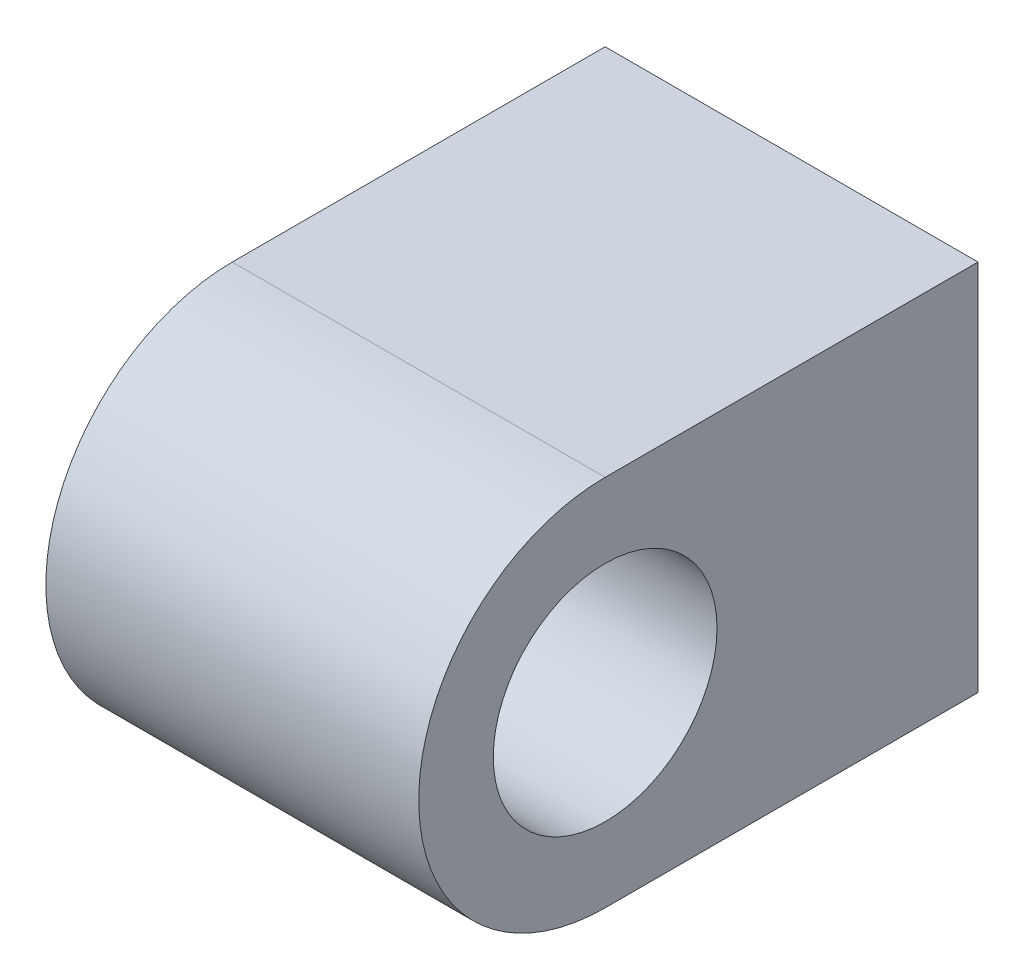
ISO-10303-21;
HEADER;
FILE_DESCRIPTION(('STEP AP214'),'2;1');
FILE_NAME('part.step','',(''),(''),'','','');
FILE_SCHEMA(('AUTOMOTIVE_DESIGN { 1 0 10303 214 1 1 1 1 }'));
ENDSEC;
DATA;
#1=APPLICATION_CONTEXT('core data for automotive mechanical design processes');
#2=APPLICATION_PROTOCOL_DEFINITION('international standard','automotive_design',2000,#1);
#3=PRODUCT_CONTEXT('',#1,'mechanical');
#4=PRODUCT('Part','Part','',(#3));
#5=PRODUCT_RELATED_PRODUCT_CATEGORY('part','',(#4));
#6=PRODUCT_DEFINITION_FORMATION('','',#4);
#7=PRODUCT_DEFINITION_CONTEXT('part definition',#1,'design');
#8=PRODUCT_DEFINITION('design','',#6,#7);
#9=PRODUCT_DEFINITION_SHAPE('','',#8);
#10=(LENGTH_UNIT() NAMED_UNIT(*) SI_UNIT(.MILLI.,.METRE.));
#11=(NAMED_UNIT(*) PLANE_ANGLE_UNIT() SI_UNIT($,.RADIAN.));
#12=(NAMED_UNIT(*) SI_UNIT($,.STERADIAN.) SOLID_ANGLE_UNIT());
#13=UNCERTAINTY_MEASURE_WITH_UNIT(LENGTH_MEASURE(1.E-05),#10,'distance_accuracy_value','');
#14=(GEOMETRIC_REPRESENTATION_CONTEXT(3) GLOBAL_UNCERTAINTY_ASSIGNED_CONTEXT((#13)) GLOBAL_UNIT_ASSIGNED_CONTEXT((#10,
#11,#12)) REPRESENTATION_CONTEXT('',''));
#15=CARTESIAN_POINT('',(0.,0.,0.));
#16=DIRECTION('',(0.,0.,1.));
#17=DIRECTION('',(1.,0.,0.));
#18=AXIS2_PLACEMENT_3D('',#15,#16,#17);
#19=CARTESIAN_POINT('',(5.,2.5,5.));
#20=DIRECTION('',(-1.,0.,0.));
#21=DIRECTION('',(0.,0.,1.));
#22=AXIS2_PLACEMENT_3D('',#19,#20,#21);
#23=CYLINDRICAL_SURFACE('',#22,2.5);
#24=CARTESIAN_POINT('',(0.,2.5,5.));
#25=DIRECTION('',(-1.,0.,0.));
#26=DIRECTION('',(0.,0.,1.));
#27=AXIS2_PLACEMENT_3D('',#24,#25,#26);
#28=CIRCLE('',#27,2.5);
#29=CARTESIAN_POINT('',(0.,0.,5.));
#30=VERTEX_POINT('',#29);
#31=CARTESIAN_POINT('',(0.,5.,5.));
#32=VERTEX_POINT('',#31);
#33=EDGE_CURVE('E98',#30,#32,#28,.T.);
#34=ORIENTED_EDGE('',*,*,#33,.F.);
#35=DIRECTION('',(-1.,0.,0.));
#36=VECTOR('',#35,1.);
#37=CARTESIAN_POINT('',(5.,0.,5.));
#38=LINE('',#37,#36);
#39=CARTESIAN_POINT('',(5.,0.,5.));
#40=VERTEX_POINT('',#39);
#41=EDGE_CURVE('E11',#40,#30,#38,.T.);
#42=ORIENTED_EDGE('',*,*,#41,.F.);
#43=CARTESIAN_POINT('',(5.,2.5,5.));
#44=DIRECTION('',(-1.,0.,0.));
#45=DIRECTION('',(0.,0.,1.));
#46=AXIS2_PLACEMENT_3D('',#43,#44,#45);
#47=CIRCLE('',#46,2.5);
#48=CARTESIAN_POINT('',(5.,5.,5.));
#49=VERTEX_POINT('',#48);
#50=EDGE_CURVE('E91',#40,#49,#47,.T.);
#51=ORIENTED_EDGE('',*,*,#50,.T.);
#52=DIRECTION('',(-1.,0.,0.));
#53=VECTOR('',#52,1.);
#54=CARTESIAN_POINT('',(5.,5.,5.));
#55=LINE('',#54,#53);
#56=EDGE_CURVE('E36',#49,#32,#55,.T.);
#57=ORIENTED_EDGE('',*,*,#56,.T.);
#58=EDGE_LOOP('',(#34,#42,#51,#57));
#59=FACE_BOUND('',#58,.T.);
#60=ADVANCED_FACE('F33',(#59),#23,.T.);
#61=CARTESIAN_POINT('',(5.,0.,0.));
#62=DIRECTION('',(0.,-1.,0.));
#63=DIRECTION('',(0.,0.,-1.));
#64=AXIS2_PLACEMENT_3D('',#61,#62,#63);
#65=PLANE('',#64);
#66=DIRECTION('',(0.,0.,1.));
#67=VECTOR('',#66,1.);
#68=CARTESIAN_POINT('',(0.,0.,0.));
#69=LINE('',#68,#67);
#70=CARTESIAN_POINT('',(0.,0.,0.));
#71=VERTEX_POINT('',#70);
#72=EDGE_CURVE('E93',#71,#30,#69,.T.);
#73=ORIENTED_EDGE('',*,*,#72,.F.);
#74=DIRECTION('',(-1.,0.,0.));
#75=VECTOR('',#74,1.);
#76=CARTESIAN_POINT('',(5.,0.,0.));
#77=LINE('',#76,#75);
#78=CARTESIAN_POINT('',(5.,0.,0.));
#79=VERTEX_POINT('',#78);
#80=EDGE_CURVE('E42',#79,#71,#77,.T.);
#81=ORIENTED_EDGE('',*,*,#80,.F.);
#82=DIRECTION('',(0.,0.,1.));
#83=VECTOR('',#82,1.);
#84=CARTESIAN_POINT('',(5.,0.,0.));
#85=LINE('',#84,#83);
#86=EDGE_CURVE('E88',#79,#40,#85,.T.);
#87=ORIENTED_EDGE('',*,*,#86,.T.);
#88=ORIENTED_EDGE('',*,*,#41,.T.);
#89=EDGE_LOOP('',(#73,#81,#87,#88));
#90=FACE_BOUND('',#89,.T.);
#91=ADVANCED_FACE('F109',(#90),#65,.T.);
#92=CARTESIAN_POINT('',(5.,5.,0.));
#93=DIRECTION('',(0.,0.,-1.));
#94=DIRECTION('',(-1.,0.,0.));
#95=AXIS2_PLACEMENT_3D('',#92,#93,#94);
#96=PLANE('',#95);
#97=DIRECTION('',(0.,-1.,0.));
#98=VECTOR('',#97,1.);
#99=CARTESIAN_POINT('',(0.,5.,0.));
#100=LINE('',#99,#98);
#101=CARTESIAN_POINT('',(0.,5.,0.));
#102=VERTEX_POINT('',#101);
#103=EDGE_CURVE('E83',#102,#71,#100,.T.);
#104=ORIENTED_EDGE('',*,*,#103,.F.);
#105=DIRECTION('',(-1.,0.,0.));
#106=VECTOR('',#105,1.);
#107=CARTESIAN_POINT('',(5.,5.,0.));
#108=LINE('',#107,#106);
#109=CARTESIAN_POINT('',(5.,5.,0.));
#110=VERTEX_POINT('',#109);
#111=EDGE_CURVE('E78',#110,#102,#108,.T.);
#112=ORIENTED_EDGE('',*,*,#111,.F.);
#113=DIRECTION('',(0.,-1.,0.));
#114=VECTOR('',#113,1.);
#115=CARTESIAN_POINT('',(5.,5.,0.));
#116=LINE('',#115,#114);
#117=EDGE_CURVE('E81',#110,#79,#116,.T.);
#118=ORIENTED_EDGE('',*,*,#117,.T.);
#119=ORIENTED_EDGE('',*,*,#80,.T.);
#120=EDGE_LOOP('',(#104,#112,#118,#119));
#121=FACE_BOUND('',#120,.T.);
#122=ADVANCED_FACE('F80',(#121),#96,.T.);
#123=CARTESIAN_POINT('',(5.,5.,5.));
#124=DIRECTION('',(0.,1.,0.));
#125=DIRECTION('',(0.,0.,1.));
#126=AXIS2_PLACEMENT_3D('',#123,#124,#125);
#127=PLANE('',#126);
#128=DIRECTION('',(0.,0.,-1.));
#129=VECTOR('',#128,1.);
#130=CARTESIAN_POINT('',(0.,5.,5.));
#131=LINE('',#130,#129);
#132=EDGE_CURVE('E101',#32,#102,#131,.T.);
#133=ORIENTED_EDGE('',*,*,#132,.F.);
#134=ORIENTED_EDGE('',*,*,#56,.F.);
#135=DIRECTION('',(0.,0.,-1.));
#136=VECTOR('',#135,1.);
#137=CARTESIAN_POINT('',(5.,5.,5.));
#138=LINE('',#137,#136);
#139=EDGE_CURVE('E87',#49,#110,#138,.T.);
#140=ORIENTED_EDGE('',*,*,#139,.T.);
#141=ORIENTED_EDGE('',*,*,#111,.T.);
#142=EDGE_LOOP('',(#133,#134,#140,#141));
#143=FACE_BOUND('',#142,.T.);
#144=ADVANCED_FACE('F90',(#143),#127,.T.);
#145=CARTESIAN_POINT('',(5.,2.5,5.));
#146=DIRECTION('',(-1.,0.,0.));
#147=DIRECTION('',(0.,0.,1.));
#148=AXIS2_PLACEMENT_3D('',#145,#146,#147);
#149=PLANE('',#148);
#150=CARTESIAN_POINT('',(5.,2.5,5.));
#151=DIRECTION('',(-1.,0.,0.));
#152=DIRECTION('',(0.,0.,-1.));
#153=AXIS2_PLACEMENT_3D('',#150,#151,#152);
#154=CIRCLE('',#153,1.5);
#155=CARTESIAN_POINT('',(5.,2.5,3.5));
#156=VERTEX_POINT('',#155);
#157=EDGE_CURVE('E102',#156,#156,#154,.T.);
#158=ORIENTED_EDGE('',*,*,#157,.T.);
#159=EDGE_LOOP('',(#158));
#160=FACE_BOUND('',#159,.T.);
#161=ORIENTED_EDGE('',*,*,#50,.F.);
#162=ORIENTED_EDGE('',*,*,#86,.F.);
#163=ORIENTED_EDGE('',*,*,#117,.F.);
#164=ORIENTED_EDGE('',*,*,#139,.F.);
#165=EDGE_LOOP('',(#161,#162,#163,#164));
#166=FACE_BOUND('',#165,.T.);
#167=ADVANCED_FACE('F86',(#160,#166),#149,.F.);
#168=CARTESIAN_POINT('',(0.,2.5,5.));
#169=DIRECTION('',(-1.,0.,0.));
#170=DIRECTION('',(0.,0.,1.));
#171=AXIS2_PLACEMENT_3D('',#168,#169,#170);
#172=PLANE('',#171);
#173=CARTESIAN_POINT('',(0.,2.5,5.));
#174=DIRECTION('',(-1.,0.,0.));
#175=DIRECTION('',(0.,0.,-1.));
#176=AXIS2_PLACEMENT_3D('',#173,#174,#175);
#177=CIRCLE('',#176,1.5);
#178=CARTESIAN_POINT('',(0.,2.5,3.5));
#179=VERTEX_POINT('',#178);
#180=EDGE_CURVE('E139',#179,#179,#177,.T.);
#181=ORIENTED_EDGE('',*,*,#180,.F.);
#182=EDGE_LOOP('',(#181));
#183=FACE_BOUND('',#182,.T.);
#184=ORIENTED_EDGE('',*,*,#33,.T.);
#185=ORIENTED_EDGE('',*,*,#132,.T.);
#186=ORIENTED_EDGE('',*,*,#103,.T.);
#187=ORIENTED_EDGE('',*,*,#72,.T.);
#188=EDGE_LOOP('',(#184,#185,#186,#187));
#189=FACE_BOUND('',#188,.T.);
#190=ADVANCED_FACE('F108',(#183,#189),#172,.T.);
#191=CARTESIAN_POINT('',(5.,2.5,5.));
#192=DIRECTION('',(-1.,0.,0.));
#193=DIRECTION('',(0.,0.,1.));
#194=AXIS2_PLACEMENT_3D('',#191,#192,#193);
#195=CYLINDRICAL_SURFACE('',#194,1.5);
#196=ORIENTED_EDGE('',*,*,#157,.F.);
#197=EDGE_LOOP('',(#196));
#198=FACE_BOUND('',#197,.T.);
#199=ORIENTED_EDGE('',*,*,#180,.T.);
#200=EDGE_LOOP('',(#199));
#201=FACE_BOUND('',#200,.T.);
#202=ADVANCED_FACE('F127',(#198,#201),#195,.F.);
#203=CLOSED_SHELL('',(#60,#91,#122,#144,#167,#190,#202));
#204=MANIFOLD_SOLID_BREP('B2',#203);
#205=ADVANCED_BREP_SHAPE_REPRESENTATION('',(#18,#204),#14);
#206=SHAPE_DEFINITION_REPRESENTATION(#9,#205);
ENDSEC;
END-ISO-10303-21;
